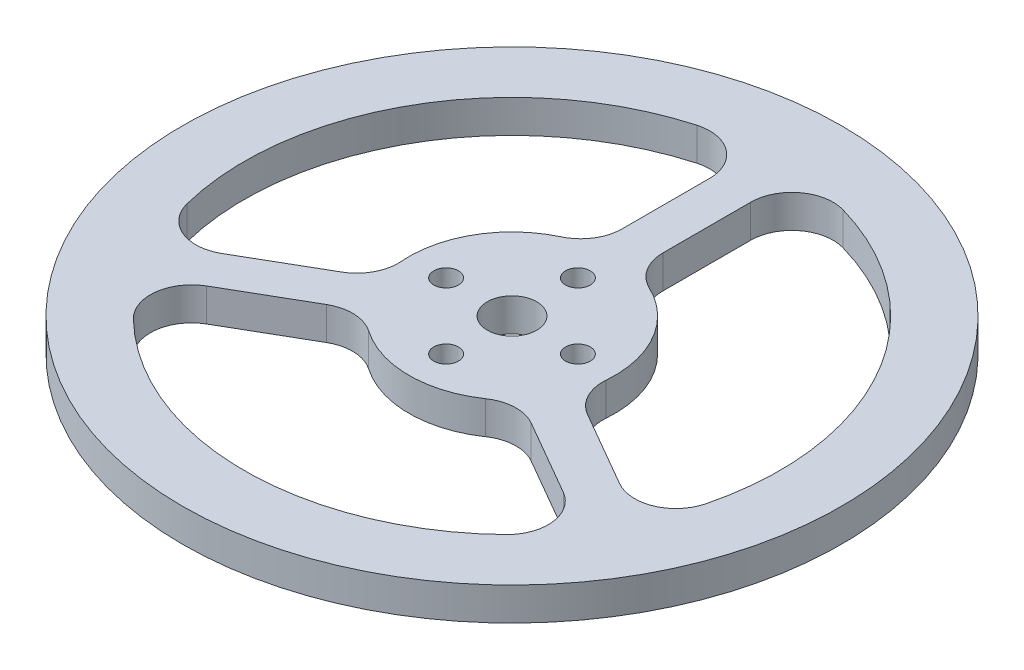
ISO-10303-21;
HEADER;
FILE_DESCRIPTION(('STEP AP214'),'2;1');
FILE_NAME('part.step','',(''),(''),'','','');
FILE_SCHEMA(('AUTOMOTIVE_DESIGN { 1 0 10303 214 1 1 1 1 }'));
ENDSEC;
DATA;
#1=APPLICATION_CONTEXT('core data for automotive mechanical design processes');
#2=APPLICATION_PROTOCOL_DEFINITION('international standard','automotive_design',2000,#1);
#3=PRODUCT_CONTEXT('',#1,'mechanical');
#4=PRODUCT('Part','Part','',(#3));
#5=PRODUCT_RELATED_PRODUCT_CATEGORY('part','',(#4));
#6=PRODUCT_DEFINITION_FORMATION('','',#4);
#7=PRODUCT_DEFINITION_CONTEXT('part definition',#1,'design');
#8=PRODUCT_DEFINITION('design','',#6,#7);
#9=PRODUCT_DEFINITION_SHAPE('','',#8);
#10=(LENGTH_UNIT() NAMED_UNIT(*) SI_UNIT(.MILLI.,.METRE.));
#11=(NAMED_UNIT(*) PLANE_ANGLE_UNIT() SI_UNIT($,.RADIAN.));
#12=(NAMED_UNIT(*) SI_UNIT($,.STERADIAN.) SOLID_ANGLE_UNIT());
#13=UNCERTAINTY_MEASURE_WITH_UNIT(LENGTH_MEASURE(1.E-05),#10,'distance_accuracy_value','');
#14=(GEOMETRIC_REPRESENTATION_CONTEXT(3) GLOBAL_UNCERTAINTY_ASSIGNED_CONTEXT((#13)) GLOBAL_UNIT_ASSIGNED_CONTEXT((#10,
#11,#12)) REPRESENTATION_CONTEXT('',''));
#15=CARTESIAN_POINT('',(0.,0.,0.));
#16=DIRECTION('',(0.,0.,1.));
#17=DIRECTION('',(1.,0.,0.));
#18=AXIS2_PLACEMENT_3D('',#15,#16,#17);
#19=CARTESIAN_POINT('',(0.,4.,0.));
#20=DIRECTION('',(0.,1.,0.));
#21=DIRECTION('',(0.,0.,1.));
#22=AXIS2_PLACEMENT_3D('',#19,#20,#21);
#23=PLANE('',#22);
#24=CARTESIAN_POINT('',(8.,4.,0.));
#25=DIRECTION('',(0.,1.,0.));
#26=DIRECTION('',(0.,0.,1.));
#27=AXIS2_PLACEMENT_3D('',#24,#25,#26);
#28=CIRCLE('',#27,1.5);
#29=CARTESIAN_POINT('',(8.,4.,1.5));
#30=VERTEX_POINT('',#29);
#31=EDGE_CURVE('E437',#30,#30,#28,.T.);
#32=ORIENTED_EDGE('',*,*,#31,.F.);
#33=EDGE_LOOP('',(#32));
#34=FACE_BOUND('',#33,.T.);
#35=CARTESIAN_POINT('',(0.,4.,0.));
#36=DIRECTION('',(0.,1.,0.));
#37=DIRECTION('',(0.,0.,1.));
#38=AXIS2_PLACEMENT_3D('',#35,#36,#37);
#39=CIRCLE('',#38,3.);
#40=CARTESIAN_POINT('',(0.,4.,3.));
#41=VERTEX_POINT('',#40);
#42=EDGE_CURVE('E432',#41,#41,#39,.T.);
#43=ORIENTED_EDGE('',*,*,#42,.F.);
#44=EDGE_LOOP('',(#43));
#45=FACE_BOUND('',#44,.T.);
#46=CARTESIAN_POINT('',(0.,4.,8.));
#47=DIRECTION('',(0.,1.,0.));
#48=DIRECTION('',(0.,0.,1.));
#49=AXIS2_PLACEMENT_3D('',#46,#47,#48);
#50=CIRCLE('',#49,1.5);
#51=CARTESIAN_POINT('',(0.,4.,9.5));
#52=VERTEX_POINT('',#51);
#53=EDGE_CURVE('E445',#52,#52,#50,.T.);
#54=ORIENTED_EDGE('',*,*,#53,.F.);
#55=EDGE_LOOP('',(#54));
#56=FACE_BOUND('',#55,.T.);
#57=CARTESIAN_POINT('',(-8.,4.,0.));
#58=DIRECTION('',(0.,1.,0.));
#59=DIRECTION('',(0.,0.,1.));
#60=AXIS2_PLACEMENT_3D('',#57,#58,#59);
#61=CIRCLE('',#60,1.5);
#62=CARTESIAN_POINT('',(-8.,4.,1.5));
#63=VERTEX_POINT('',#62);
#64=EDGE_CURVE('E444',#63,#63,#61,.T.);
#65=ORIENTED_EDGE('',*,*,#64,.F.);
#66=EDGE_LOOP('',(#65));
#67=FACE_BOUND('',#66,.T.);
#68=CARTESIAN_POINT('',(0.,4.,-8.));
#69=DIRECTION('',(0.,1.,0.));
#70=DIRECTION('',(0.,0.,1.));
#71=AXIS2_PLACEMENT_3D('',#68,#69,#70);
#72=CIRCLE('',#71,1.5);
#73=CARTESIAN_POINT('',(0.,4.,-6.5));
#74=VERTEX_POINT('',#73);
#75=EDGE_CURVE('E455',#74,#74,#72,.T.);
#76=ORIENTED_EDGE('',*,*,#75,.F.);
#77=EDGE_LOOP('',(#76));
#78=FACE_BOUND('',#77,.T.);
#79=CARTESIAN_POINT('',(0.,4.,0.));
#80=DIRECTION('',(0.,1.,0.));
#81=DIRECTION('',(0.,0.,1.));
#82=AXIS2_PLACEMENT_3D('',#79,#80,#81);
#83=CIRCLE('',#82,40.);
#84=CARTESIAN_POINT('',(0.,4.,40.));
#85=VERTEX_POINT('',#84);
#86=EDGE_CURVE('E463',#85,#85,#83,.T.);
#87=ORIENTED_EDGE('',*,*,#86,.T.);
#88=EDGE_LOOP('',(#87));
#89=FACE_BOUND('',#88,.T.);
#90=DIRECTION('',(0.,0.,-1.));
#91=VECTOR('',#90,1.);
#92=CARTESIAN_POINT('',(-2.4721976034128,4.,0.));
#93=LINE('',#92,#91);
#94=CARTESIAN_POINT('',(-2.4721976034128,4.,-15.82454621705));
#95=VERTEX_POINT('',#94);
#96=CARTESIAN_POINT('',(-2.4721976034128,4.,-26.4653785723075));
#97=VERTEX_POINT('',#96);
#98=EDGE_CURVE('E423',#95,#97,#93,.T.);
#99=ORIENTED_EDGE('',*,*,#98,.F.);
#100=CARTESIAN_POINT('',(-7.4721976034128,4.,-15.82454621705));
#101=DIRECTION('',(0.,1.,0.));
#102=DIRECTION('',(0.,0.,1.));
#103=AXIS2_PLACEMENT_3D('',#100,#101,#102);
#104=CIRCLE('',#103,5.);
#105=CARTESIAN_POINT('',(-5.33728400243771,4.,-11.3032472978929));
#106=VERTEX_POINT('',#105);
#107=EDGE_CURVE('E290',#95,#106,#104,.F.);
#108=ORIENTED_EDGE('',*,*,#107,.T.);
#109=CARTESIAN_POINT('',(0.,4.,0.));
#110=DIRECTION('',(0.,1.,0.));
#111=DIRECTION('',(0.,0.,1.));
#112=AXIS2_PLACEMENT_3D('',#109,#110,#111);
#113=CIRCLE('',#112,12.5);
#114=CARTESIAN_POINT('',(-12.4610844162261,4.,0.985583670566415));
#115=VERTEX_POINT('',#114);
#116=EDGE_CURVE('E420',#106,#115,#113,.T.);
#117=ORIENTED_EDGE('',*,*,#116,.T.);
#118=CARTESIAN_POINT('',(-17.4455181827165,4.,1.37981713879298));
#119=DIRECTION('',(0.,1.,0.));
#120=DIRECTION('',(0.,0.,1.));
#121=AXIS2_PLACEMENT_3D('',#118,#119,#120);
#122=CIRCLE('',#121,5.);
#123=CARTESIAN_POINT('',(-14.9455181827165,4.,5.70994415771517));
#124=VERTEX_POINT('',#123);
#125=EDGE_CURVE('E294',#115,#124,#122,.F.);
#126=ORIENTED_EDGE('',*,*,#125,.T.);
#127=DIRECTION('',(-0.866025403784438,0.,0.5));
#128=VECTOR('',#127,1.);
#129=CARTESIAN_POINT('',(-1.2639011982932,4.,-2.189141091191));
#130=LINE('',#129,#128);
#131=CARTESIAN_POINT('',(-24.1699406488063,4.,11.0356669516309));
#132=VERTEX_POINT('',#131);
#133=EDGE_CURVE('E429',#124,#132,#130,.T.);
#134=ORIENTED_EDGE('',*,*,#133,.T.);
#135=CARTESIAN_POINT('',(-26.6699406488063,4.,6.70553993270872));
#136=DIRECTION('',(0.,1.,0.));
#137=DIRECTION('',(0.,0.,1.));
#138=AXIS2_PLACEMENT_3D('',#135,#136,#137);
#139=CIRCLE('',#138,5.);
#140=CARTESIAN_POINT('',(-31.519020766771,4.,7.92472901138304));
#141=VERTEX_POINT('',#140);
#142=EDGE_CURVE('E277',#132,#141,#139,.F.);
#143=ORIENTED_EDGE('',*,*,#142,.T.);
#144=CARTESIAN_POINT('',(0.,4.,0.));
#145=DIRECTION('',(0.,1.,0.));
#146=DIRECTION('',(0.,0.,1.));
#147=AXIS2_PLACEMENT_3D('',#144,#145,#146);
#148=CIRCLE('',#147,32.5);
#149=CARTESIAN_POINT('',(-8.83077898585149,4.,-31.2772655854543));
#150=VERTEX_POINT('',#149);
#151=EDGE_CURVE('E426',#150,#141,#148,.T.);
#152=ORIENTED_EDGE('',*,*,#151,.F.);
#153=CARTESIAN_POINT('',(-7.4721976034128,4.,-26.4653785723075));
#154=DIRECTION('',(0.,1.,0.));
#155=DIRECTION('',(0.,0.,1.));
#156=AXIS2_PLACEMENT_3D('',#153,#154,#155);
#157=CIRCLE('',#156,5.);
#158=EDGE_CURVE('E286',#150,#97,#157,.F.);
#159=ORIENTED_EDGE('',*,*,#158,.T.);
#160=EDGE_LOOP('',(#99,#108,#117,#126,#134,#143,#152,#159));
#161=FACE_BOUND('',#160,.T.);
#162=DIRECTION('',(-0.866025403784438,0.,0.5));
#163=VECTOR('',#162,1.);
#164=CARTESIAN_POINT('',(1.23609880170681,4.,2.14098592773119));
#165=LINE('',#164,#163);
#166=CARTESIAN_POINT('',(-12.4683602256191,4.,10.053259036256));
#167=VERTEX_POINT('',#166);
#168=CARTESIAN_POINT('',(-21.6835913626836,4.,15.3736752138848));
#169=VERTEX_POINT('',#168);
#170=EDGE_CURVE('E411',#167,#169,#165,.T.);
#171=ORIENTED_EDGE('',*,*,#170,.F.);
#172=CARTESIAN_POINT('',(-9.96836022561911,4.,14.3833860551782));
#173=DIRECTION('',(0.,1.,0.));
#174=DIRECTION('',(0.,0.,1.));
#175=AXIS2_PLACEMENT_3D('',#172,#173,#174);
#176=CIRCLE('',#175,5.);
#177=CARTESIAN_POINT('',(-7.12025730401365,4.,10.2738471822701));
#178=VERTEX_POINT('',#177);
#179=EDGE_CURVE('E278',#167,#178,#176,.F.);
#180=ORIENTED_EDGE('',*,*,#179,.T.);
#181=CARTESIAN_POINT('',(0.,4.,0.));
#182=DIRECTION('',(0.,1.,0.));
#183=DIRECTION('',(0.,0.,1.));
#184=AXIS2_PLACEMENT_3D('',#181,#182,#183);
#185=CIRCLE('',#184,12.5);
#186=CARTESIAN_POINT('',(7.08408270437887,4.,10.2988238278708));
#187=VERTEX_POINT('',#186);
#188=EDGE_CURVE('E255',#178,#187,#185,.T.);
#189=ORIENTED_EDGE('',*,*,#188,.T.);
#190=CARTESIAN_POINT('',(9.91771578613042,4.,14.4183533590192));
#191=DIRECTION('',(0.,1.,0.));
#192=DIRECTION('',(0.,0.,1.));
#193=AXIS2_PLACEMENT_3D('',#190,#191,#192);
#194=CIRCLE('',#193,5.);
#195=CARTESIAN_POINT('',(12.4177157861304,4.,10.088226340097));
#196=VERTEX_POINT('',#195);
#197=EDGE_CURVE('E353',#187,#196,#194,.F.);
#198=ORIENTED_EDGE('',*,*,#197,.T.);
#199=DIRECTION('',(0.866025403784439,0.,0.5));
#200=VECTOR('',#199,1.);
#201=CARTESIAN_POINT('',(-1.26390119829305,4.,2.18914109119074));
#202=LINE('',#201,#200);
#203=CARTESIAN_POINT('',(21.6421382522201,4.,15.4139491340127));
#204=VERTEX_POINT('',#203);
#205=EDGE_CURVE('E358',#196,#204,#202,.T.);
#206=ORIENTED_EDGE('',*,*,#205,.T.);
#207=CARTESIAN_POINT('',(19.1421382522201,4.,19.7440761529349));
#208=DIRECTION('',(0.,1.,0.));
#209=DIRECTION('',(0.,0.,1.));
#210=AXIS2_PLACEMENT_3D('',#207,#208,#209);
#211=CIRCLE('',#210,5.);
#212=CARTESIAN_POINT('',(22.622527025351,4.,23.3339081807412));
#213=VERTEX_POINT('',#212);
#214=EDGE_CURVE('E298',#204,#213,#211,.F.);
#215=ORIENTED_EDGE('',*,*,#214,.T.);
#216=CARTESIAN_POINT('',(0.,4.,0.));
#217=DIRECTION('',(0.,1.,0.));
#218=DIRECTION('',(0.,0.,1.));
#219=AXIS2_PLACEMENT_3D('',#216,#217,#218);
#220=CIRCLE('',#219,32.5);
#221=CARTESIAN_POINT('',(-22.6715170649897,4.,23.286311729681));
#222=VERTEX_POINT('',#221);
#223=EDGE_CURVE('E369',#222,#213,#220,.T.);
#224=ORIENTED_EDGE('',*,*,#223,.F.);
#225=CARTESIAN_POINT('',(-19.1835913626836,4.,19.703802232807));
#226=DIRECTION('',(0.,1.,0.));
#227=DIRECTION('',(0.,0.,1.));
#228=AXIS2_PLACEMENT_3D('',#225,#226,#227);
#229=CIRCLE('',#228,5.);
#230=EDGE_CURVE('E306',#222,#169,#229,.F.);
#231=ORIENTED_EDGE('',*,*,#230,.T.);
#232=EDGE_LOOP('',(#171,#180,#189,#198,#206,#215,#224,#231));
#233=FACE_BOUND('',#232,.T.);
#234=DIRECTION('',(0.866025403784439,0.,0.5));
#235=VECTOR('',#234,1.);
#236=CARTESIAN_POINT('',(1.23609880170695,4.,-2.14098592773145));
#237=LINE('',#236,#235);
#238=CARTESIAN_POINT('',(14.9405578290328,4.,5.77128718079329));
#239=VERTEX_POINT('',#238);
#240=CARTESIAN_POINT('',(24.1557889660973,4.,11.0917033584221));
#241=VERTEX_POINT('',#240);
#242=EDGE_CURVE('E329',#239,#241,#237,.T.);
#243=ORIENTED_EDGE('',*,*,#242,.F.);
#244=CARTESIAN_POINT('',(17.4405578290328,4.,1.4411601618711));
#245=DIRECTION('',(0.,1.,0.));
#246=DIRECTION('',(0.,0.,1.));
#247=AXIS2_PLACEMENT_3D('',#244,#245,#246);
#248=CIRCLE('',#247,5.);
#249=CARTESIAN_POINT('',(12.457541306452,4.,1.02940011562221));
#250=VERTEX_POINT('',#249);
#251=EDGE_CURVE('E310',#239,#250,#248,.F.);
#252=ORIENTED_EDGE('',*,*,#251,.T.);
#253=CARTESIAN_POINT('',(0.,4.,0.));
#254=DIRECTION('',(0.,1.,0.));
#255=DIRECTION('',(0.,0.,1.));
#256=AXIS2_PLACEMENT_3D('',#253,#254,#255);
#257=CIRCLE('',#256,12.5);
#258=CARTESIAN_POINT('',(5.377001711848,4.,-11.2844074984371));
#259=VERTEX_POINT('',#258);
#260=EDGE_CURVE('E368',#250,#259,#257,.T.);
#261=ORIENTED_EDGE('',*,*,#260,.T.);
#262=CARTESIAN_POINT('',(7.5278023965872,4.,-15.798170497812));
#263=DIRECTION('',(0.,1.,0.));
#264=DIRECTION('',(0.,0.,1.));
#265=AXIS2_PLACEMENT_3D('',#262,#263,#264);
#266=CIRCLE('',#265,5.);
#267=CARTESIAN_POINT('',(2.5278023965872,4.,-15.798170497812));
#268=VERTEX_POINT('',#267);
#269=EDGE_CURVE('E108',#259,#268,#266,.F.);
#270=ORIENTED_EDGE('',*,*,#269,.T.);
#271=DIRECTION('',(0.,0.,-1.));
#272=VECTOR('',#271,1.);
#273=CARTESIAN_POINT('',(2.5278023965872,4.,0.));
#274=LINE('',#273,#272);
#275=CARTESIAN_POINT('',(2.5278023965872,4.,-26.4496160856436));
#276=VERTEX_POINT('',#275);
#277=EDGE_CURVE('E320',#268,#276,#274,.T.);
#278=ORIENTED_EDGE('',*,*,#277,.T.);
#279=CARTESIAN_POINT('',(7.5278023965872,4.,-26.4496160856436));
#280=DIRECTION('',(0.,1.,0.));
#281=DIRECTION('',(0.,0.,1.));
#282=AXIS2_PLACEMENT_3D('',#279,#280,#281);
#283=CIRCLE('',#282,5.);
#284=CARTESIAN_POINT('',(8.89649374142124,4.,-31.2586371921242));
#285=VERTEX_POINT('',#284);
#286=EDGE_CURVE('E94',#276,#285,#283,.F.);
#287=ORIENTED_EDGE('',*,*,#286,.T.);
#288=CARTESIAN_POINT('',(0.,4.,0.));
#289=DIRECTION('',(0.,1.,0.));
#290=DIRECTION('',(0.,0.,1.));
#291=AXIS2_PLACEMENT_3D('',#288,#289,#290);
#292=CIRCLE('',#291,32.5);
#293=CARTESIAN_POINT('',(31.5022960508423,4.,7.99095385577265));
#294=VERTEX_POINT('',#293);
#295=EDGE_CURVE('E319',#294,#285,#292,.T.);
#296=ORIENTED_EDGE('',*,*,#295,.F.);
#297=CARTESIAN_POINT('',(26.6557889660973,4.,6.76157633949993));
#298=DIRECTION('',(0.,1.,0.));
#299=DIRECTION('',(0.,0.,1.));
#300=AXIS2_PLACEMENT_3D('',#297,#298,#299);
#301=CIRCLE('',#300,5.);
#302=EDGE_CURVE('E302',#294,#241,#301,.F.);
#303=ORIENTED_EDGE('',*,*,#302,.T.);
#304=EDGE_LOOP('',(#243,#252,#261,#270,#278,#287,#296,#303));
#305=FACE_BOUND('',#304,.T.);
#306=ADVANCED_FACE('F86',(#34,#45,#56,#67,#78,#89,#161,#233,#305),#23,.T.);
#307=CARTESIAN_POINT('',(0.,0.,0.));
#308=DIRECTION('',(0.,1.,0.));
#309=DIRECTION('',(0.,0.,1.));
#310=AXIS2_PLACEMENT_3D('',#307,#308,#309);
#311=PLANE('',#310);
#312=CARTESIAN_POINT('',(0.,0.,0.));
#313=DIRECTION('',(0.,1.,0.));
#314=DIRECTION('',(0.,0.,1.));
#315=AXIS2_PLACEMENT_3D('',#312,#313,#314);
#316=CIRCLE('',#315,12.5);
#317=CARTESIAN_POINT('',(-7.12025730401365,0.,10.2738471822701));
#318=VERTEX_POINT('',#317);
#319=CARTESIAN_POINT('',(7.08408270437887,0.,10.2988238278708));
#320=VERTEX_POINT('',#319);
#321=EDGE_CURVE('E252',#318,#320,#316,.T.);
#322=ORIENTED_EDGE('',*,*,#321,.F.);
#323=CARTESIAN_POINT('',(-9.96836022561911,0.,14.3833860551782));
#324=DIRECTION('',(0.,1.,0.));
#325=DIRECTION('',(0.,0.,1.));
#326=AXIS2_PLACEMENT_3D('',#323,#324,#325);
#327=CIRCLE('',#326,5.);
#328=CARTESIAN_POINT('',(-12.4683602256191,0.,10.053259036256));
#329=VERTEX_POINT('',#328);
#330=EDGE_CURVE('E265',#318,#329,#327,.T.);
#331=ORIENTED_EDGE('',*,*,#330,.T.);
#332=DIRECTION('',(-0.866025403784438,0.,0.5));
#333=VECTOR('',#332,1.);
#334=CARTESIAN_POINT('',(1.23609880170681,0.,2.14098592773119));
#335=LINE('',#334,#333);
#336=CARTESIAN_POINT('',(-21.6835913626836,0.,15.3736752138848));
#337=VERTEX_POINT('',#336);
#338=EDGE_CURVE('E480',#329,#337,#335,.T.);
#339=ORIENTED_EDGE('',*,*,#338,.T.);
#340=CARTESIAN_POINT('',(-19.1835913626836,0.,19.703802232807));
#341=DIRECTION('',(0.,1.,0.));
#342=DIRECTION('',(0.,0.,1.));
#343=AXIS2_PLACEMENT_3D('',#340,#341,#342);
#344=CIRCLE('',#343,5.);
#345=CARTESIAN_POINT('',(-22.6715170649897,0.,23.286311729681));
#346=VERTEX_POINT('',#345);
#347=EDGE_CURVE('E308',#337,#346,#344,.T.);
#348=ORIENTED_EDGE('',*,*,#347,.T.);
#349=CARTESIAN_POINT('',(0.,0.,0.));
#350=DIRECTION('',(0.,1.,0.));
#351=DIRECTION('',(0.,0.,1.));
#352=AXIS2_PLACEMENT_3D('',#349,#350,#351);
#353=CIRCLE('',#352,32.5);
#354=CARTESIAN_POINT('',(22.622527025351,0.,23.3339081807412));
#355=VERTEX_POINT('',#354);
#356=EDGE_CURVE('E407',#346,#355,#353,.T.);
#357=ORIENTED_EDGE('',*,*,#356,.T.);
#358=CARTESIAN_POINT('',(19.1421382522201,0.,19.7440761529349));
#359=DIRECTION('',(0.,1.,0.));
#360=DIRECTION('',(0.,0.,1.));
#361=AXIS2_PLACEMENT_3D('',#358,#359,#360);
#362=CIRCLE('',#361,5.);
#363=CARTESIAN_POINT('',(21.6421382522201,0.,15.4139491340127));
#364=VERTEX_POINT('',#363);
#365=EDGE_CURVE('E300',#355,#364,#362,.T.);
#366=ORIENTED_EDGE('',*,*,#365,.T.);
#367=DIRECTION('',(0.866025403784439,0.,0.5));
#368=VECTOR('',#367,1.);
#369=CARTESIAN_POINT('',(-1.26390119829305,0.,2.18914109119074));
#370=LINE('',#369,#368);
#371=CARTESIAN_POINT('',(12.4177157861304,0.,10.088226340097));
#372=VERTEX_POINT('',#371);
#373=EDGE_CURVE('E271',#372,#364,#370,.T.);
#374=ORIENTED_EDGE('',*,*,#373,.F.);
#375=CARTESIAN_POINT('',(9.91771578613042,0.,14.4183533590192));
#376=DIRECTION('',(0.,1.,0.));
#377=DIRECTION('',(0.,0.,1.));
#378=AXIS2_PLACEMENT_3D('',#375,#376,#377);
#379=CIRCLE('',#378,5.);
#380=EDGE_CURVE('E269',#372,#320,#379,.T.);
#381=ORIENTED_EDGE('',*,*,#380,.T.);
#382=EDGE_LOOP('',(#322,#331,#339,#348,#357,#366,#374,#381));
#383=FACE_BOUND('',#382,.T.);
#384=CARTESIAN_POINT('',(0.,0.,0.));
#385=DIRECTION('',(0.,1.,0.));
#386=DIRECTION('',(0.,0.,1.));
#387=AXIS2_PLACEMENT_3D('',#384,#385,#386);
#388=CIRCLE('',#387,40.);
#389=CARTESIAN_POINT('',(0.,0.,40.));
#390=VERTEX_POINT('',#389);
#391=EDGE_CURVE('E436',#390,#390,#388,.T.);
#392=ORIENTED_EDGE('',*,*,#391,.F.);
#393=EDGE_LOOP('',(#392));
#394=FACE_BOUND('',#393,.T.);
#395=CARTESIAN_POINT('',(0.,0.,-8.));
#396=DIRECTION('',(0.,1.,0.));
#397=DIRECTION('',(0.,0.,1.));
#398=AXIS2_PLACEMENT_3D('',#395,#396,#397);
#399=CIRCLE('',#398,1.5);
#400=CARTESIAN_POINT('',(0.,0.,-6.5));
#401=VERTEX_POINT('',#400);
#402=EDGE_CURVE('E440',#401,#401,#399,.T.);
#403=ORIENTED_EDGE('',*,*,#402,.T.);
#404=EDGE_LOOP('',(#403));
#405=FACE_BOUND('',#404,.T.);
#406=CARTESIAN_POINT('',(-8.,0.,0.));
#407=DIRECTION('',(0.,1.,0.));
#408=DIRECTION('',(0.,0.,1.));
#409=AXIS2_PLACEMENT_3D('',#406,#407,#408);
#410=CIRCLE('',#409,1.5);
#411=CARTESIAN_POINT('',(-8.,0.,1.5));
#412=VERTEX_POINT('',#411);
#413=EDGE_CURVE('E458',#412,#412,#410,.T.);
#414=ORIENTED_EDGE('',*,*,#413,.T.);
#415=EDGE_LOOP('',(#414));
#416=FACE_BOUND('',#415,.T.);
#417=CARTESIAN_POINT('',(0.,0.,8.));
#418=DIRECTION('',(0.,1.,0.));
#419=DIRECTION('',(0.,0.,1.));
#420=AXIS2_PLACEMENT_3D('',#417,#418,#419);
#421=CIRCLE('',#420,1.5);
#422=CARTESIAN_POINT('',(0.,0.,9.5));
#423=VERTEX_POINT('',#422);
#424=EDGE_CURVE('E441',#423,#423,#421,.T.);
#425=ORIENTED_EDGE('',*,*,#424,.T.);
#426=EDGE_LOOP('',(#425));
#427=FACE_BOUND('',#426,.T.);
#428=CARTESIAN_POINT('',(0.,0.,0.));
#429=DIRECTION('',(0.,1.,0.));
#430=DIRECTION('',(0.,0.,1.));
#431=AXIS2_PLACEMENT_3D('',#428,#429,#430);
#432=CIRCLE('',#431,3.);
#433=CARTESIAN_POINT('',(0.,0.,3.));
#434=VERTEX_POINT('',#433);
#435=EDGE_CURVE('E448',#434,#434,#432,.T.);
#436=ORIENTED_EDGE('',*,*,#435,.T.);
#437=EDGE_LOOP('',(#436));
#438=FACE_BOUND('',#437,.T.);
#439=CARTESIAN_POINT('',(8.,0.,0.));
#440=DIRECTION('',(0.,1.,0.));
#441=DIRECTION('',(0.,0.,1.));
#442=AXIS2_PLACEMENT_3D('',#439,#440,#441);
#443=CIRCLE('',#442,1.5);
#444=CARTESIAN_POINT('',(8.,0.,1.5));
#445=VERTEX_POINT('',#444);
#446=EDGE_CURVE('E433',#445,#445,#443,.T.);
#447=ORIENTED_EDGE('',*,*,#446,.T.);
#448=EDGE_LOOP('',(#447));
#449=FACE_BOUND('',#448,.T.);
#450=CARTESIAN_POINT('',(0.,0.,0.));
#451=DIRECTION('',(0.,1.,0.));
#452=DIRECTION('',(0.,0.,1.));
#453=AXIS2_PLACEMENT_3D('',#450,#451,#452);
#454=CIRCLE('',#453,12.5);
#455=CARTESIAN_POINT('',(-5.33728400243771,0.,-11.3032472978929));
#456=VERTEX_POINT('',#455);
#457=CARTESIAN_POINT('',(-12.4610844162261,0.,0.985583670566415));
#458=VERTEX_POINT('',#457);
#459=EDGE_CURVE('E477',#456,#458,#454,.T.);
#460=ORIENTED_EDGE('',*,*,#459,.F.);
#461=CARTESIAN_POINT('',(-7.4721976034128,0.,-15.82454621705));
#462=DIRECTION('',(0.,1.,0.));
#463=DIRECTION('',(0.,0.,1.));
#464=AXIS2_PLACEMENT_3D('',#461,#462,#463);
#465=CIRCLE('',#464,5.);
#466=CARTESIAN_POINT('',(-2.4721976034128,0.,-15.82454621705));
#467=VERTEX_POINT('',#466);
#468=EDGE_CURVE('E292',#456,#467,#465,.T.);
#469=ORIENTED_EDGE('',*,*,#468,.T.);
#470=DIRECTION('',(0.,0.,-1.));
#471=VECTOR('',#470,1.);
#472=CARTESIAN_POINT('',(-2.4721976034128,0.,0.));
#473=LINE('',#472,#471);
#474=CARTESIAN_POINT('',(-2.4721976034128,0.,-26.4653785723075));
#475=VERTEX_POINT('',#474);
#476=EDGE_CURVE('E466',#467,#475,#473,.T.);
#477=ORIENTED_EDGE('',*,*,#476,.T.);
#478=CARTESIAN_POINT('',(-7.4721976034128,0.,-26.4653785723075));
#479=DIRECTION('',(0.,1.,0.));
#480=DIRECTION('',(0.,0.,1.));
#481=AXIS2_PLACEMENT_3D('',#478,#479,#480);
#482=CIRCLE('',#481,5.);
#483=CARTESIAN_POINT('',(-8.83077898585149,0.,-31.2772655854543));
#484=VERTEX_POINT('',#483);
#485=EDGE_CURVE('E288',#475,#484,#482,.T.);
#486=ORIENTED_EDGE('',*,*,#485,.T.);
#487=CARTESIAN_POINT('',(0.,0.,0.));
#488=DIRECTION('',(0.,1.,0.));
#489=DIRECTION('',(0.,0.,1.));
#490=AXIS2_PLACEMENT_3D('',#487,#488,#489);
#491=CIRCLE('',#490,32.5);
#492=CARTESIAN_POINT('',(-31.519020766771,0.,7.92472901138304));
#493=VERTEX_POINT('',#492);
#494=EDGE_CURVE('E471',#484,#493,#491,.T.);
#495=ORIENTED_EDGE('',*,*,#494,.T.);
#496=CARTESIAN_POINT('',(-26.6699406488063,0.,6.70553993270872));
#497=DIRECTION('',(0.,1.,0.));
#498=DIRECTION('',(0.,0.,1.));
#499=AXIS2_PLACEMENT_3D('',#496,#497,#498);
#500=CIRCLE('',#499,5.);
#501=CARTESIAN_POINT('',(-24.1699406488063,0.,11.0356669516309));
#502=VERTEX_POINT('',#501);
#503=EDGE_CURVE('E280',#493,#502,#500,.T.);
#504=ORIENTED_EDGE('',*,*,#503,.T.);
#505=DIRECTION('',(-0.866025403784438,0.,0.5));
#506=VECTOR('',#505,1.);
#507=CARTESIAN_POINT('',(-1.2639011982932,0.,-2.189141091191));
#508=LINE('',#507,#506);
#509=CARTESIAN_POINT('',(-14.9455181827165,0.,5.70994415771517));
#510=VERTEX_POINT('',#509);
#511=EDGE_CURVE('E474',#510,#502,#508,.T.);
#512=ORIENTED_EDGE('',*,*,#511,.F.);
#513=CARTESIAN_POINT('',(-17.4455181827165,0.,1.37981713879298));
#514=DIRECTION('',(0.,1.,0.));
#515=DIRECTION('',(0.,0.,1.));
#516=AXIS2_PLACEMENT_3D('',#513,#514,#515);
#517=CIRCLE('',#516,5.);
#518=EDGE_CURVE('E296',#510,#458,#517,.T.);
#519=ORIENTED_EDGE('',*,*,#518,.T.);
#520=EDGE_LOOP('',(#460,#469,#477,#486,#495,#504,#512,#519));
#521=FACE_BOUND('',#520,.T.);
#522=CARTESIAN_POINT('',(0.,0.,0.));
#523=DIRECTION('',(0.,1.,0.));
#524=DIRECTION('',(0.,0.,1.));
#525=AXIS2_PLACEMENT_3D('',#522,#523,#524);
#526=CIRCLE('',#525,12.5);
#527=CARTESIAN_POINT('',(12.457541306452,0.,1.02940011562221));
#528=VERTEX_POINT('',#527);
#529=CARTESIAN_POINT('',(5.377001711848,0.,-11.2844074984371));
#530=VERTEX_POINT('',#529);
#531=EDGE_CURVE('E259',#528,#530,#526,.T.);
#532=ORIENTED_EDGE('',*,*,#531,.F.);
#533=CARTESIAN_POINT('',(17.4405578290328,0.,1.4411601618711));
#534=DIRECTION('',(0.,1.,0.));
#535=DIRECTION('',(0.,0.,1.));
#536=AXIS2_PLACEMENT_3D('',#533,#534,#535);
#537=CIRCLE('',#536,5.);
#538=CARTESIAN_POINT('',(14.9405578290328,0.,5.77128718079329));
#539=VERTEX_POINT('',#538);
#540=EDGE_CURVE('E312',#528,#539,#537,.T.);
#541=ORIENTED_EDGE('',*,*,#540,.T.);
#542=DIRECTION('',(0.866025403784439,0.,0.5));
#543=VECTOR('',#542,1.);
#544=CARTESIAN_POINT('',(1.23609880170695,0.,-2.14098592773145));
#545=LINE('',#544,#543);
#546=CARTESIAN_POINT('',(24.1557889660973,0.,11.0917033584221));
#547=VERTEX_POINT('',#546);
#548=EDGE_CURVE('E270',#539,#547,#545,.T.);
#549=ORIENTED_EDGE('',*,*,#548,.T.);
#550=CARTESIAN_POINT('',(26.6557889660973,0.,6.76157633949993));
#551=DIRECTION('',(0.,1.,0.));
#552=DIRECTION('',(0.,0.,1.));
#553=AXIS2_PLACEMENT_3D('',#550,#551,#552);
#554=CIRCLE('',#553,5.);
#555=CARTESIAN_POINT('',(31.5022960508423,0.,7.99095385577265));
#556=VERTEX_POINT('',#555);
#557=EDGE_CURVE('E304',#547,#556,#554,.T.);
#558=ORIENTED_EDGE('',*,*,#557,.T.);
#559=CARTESIAN_POINT('',(0.,0.,0.));
#560=DIRECTION('',(0.,1.,0.));
#561=DIRECTION('',(0.,0.,1.));
#562=AXIS2_PLACEMENT_3D('',#559,#560,#561);
#563=CIRCLE('',#562,32.5);
#564=CARTESIAN_POINT('',(8.89649374142124,0.,-31.2586371921242));
#565=VERTEX_POINT('',#564);
#566=EDGE_CURVE('E486',#556,#565,#563,.T.);
#567=ORIENTED_EDGE('',*,*,#566,.T.);
#568=CARTESIAN_POINT('',(7.5278023965872,0.,-26.4496160856436));
#569=DIRECTION('',(0.,1.,0.));
#570=DIRECTION('',(0.,0.,1.));
#571=AXIS2_PLACEMENT_3D('',#568,#569,#570);
#572=CIRCLE('',#571,5.);
#573=CARTESIAN_POINT('',(2.5278023965872,0.,-26.4496160856436));
#574=VERTEX_POINT('',#573);
#575=EDGE_CURVE('E12',#565,#574,#572,.T.);
#576=ORIENTED_EDGE('',*,*,#575,.T.);
#577=DIRECTION('',(0.,0.,-1.));
#578=VECTOR('',#577,1.);
#579=CARTESIAN_POINT('',(2.5278023965872,0.,0.));
#580=LINE('',#579,#578);
#581=CARTESIAN_POINT('',(2.5278023965872,0.,-15.798170497812));
#582=VERTEX_POINT('',#581);
#583=EDGE_CURVE('E488',#582,#574,#580,.T.);
#584=ORIENTED_EDGE('',*,*,#583,.F.);
#585=CARTESIAN_POINT('',(7.5278023965872,0.,-15.798170497812));
#586=DIRECTION('',(0.,1.,0.));
#587=DIRECTION('',(0.,0.,1.));
#588=AXIS2_PLACEMENT_3D('',#585,#586,#587);
#589=CIRCLE('',#588,5.);
#590=EDGE_CURVE('E315',#582,#530,#589,.T.);
#591=ORIENTED_EDGE('',*,*,#590,.T.);
#592=EDGE_LOOP('',(#532,#541,#549,#558,#567,#576,#584,#591));
#593=FACE_BOUND('',#592,.T.);
#594=ADVANCED_FACE('F262',(#383,#394,#405,#416,#427,#438,#449,#521,#593),#311,.F.);
#595=CARTESIAN_POINT('',(0.,4.,0.));
#596=DIRECTION('',(0.,-1.,0.));
#597=DIRECTION('',(0.,0.,-1.));
#598=AXIS2_PLACEMENT_3D('',#595,#596,#597);
#599=CYLINDRICAL_SURFACE('',#598,40.);
#600=ORIENTED_EDGE('',*,*,#86,.F.);
#601=EDGE_LOOP('',(#600));
#602=FACE_BOUND('',#601,.T.);
#603=ORIENTED_EDGE('',*,*,#391,.T.);
#604=EDGE_LOOP('',(#603));
#605=FACE_BOUND('',#604,.T.);
#606=ADVANCED_FACE('F531',(#602,#605),#599,.T.);
#607=CARTESIAN_POINT('',(0.,0.,-8.));
#608=DIRECTION('',(0.,1.,0.));
#609=DIRECTION('',(0.,0.,1.));
#610=AXIS2_PLACEMENT_3D('',#607,#608,#609);
#611=CYLINDRICAL_SURFACE('',#610,1.5);
#612=ORIENTED_EDGE('',*,*,#402,.F.);
#613=EDGE_LOOP('',(#612));
#614=FACE_BOUND('',#613,.T.);
#615=ORIENTED_EDGE('',*,*,#75,.T.);
#616=EDGE_LOOP('',(#615));
#617=FACE_BOUND('',#616,.T.);
#618=ADVANCED_FACE('F541',(#614,#617),#611,.F.);
#619=CARTESIAN_POINT('',(-8.,0.,0.));
#620=DIRECTION('',(0.,1.,0.));
#621=DIRECTION('',(0.,0.,1.));
#622=AXIS2_PLACEMENT_3D('',#619,#620,#621);
#623=CYLINDRICAL_SURFACE('',#622,1.5);
#624=ORIENTED_EDGE('',*,*,#413,.F.);
#625=EDGE_LOOP('',(#624));
#626=FACE_BOUND('',#625,.T.);
#627=ORIENTED_EDGE('',*,*,#64,.T.);
#628=EDGE_LOOP('',(#627));
#629=FACE_BOUND('',#628,.T.);
#630=ADVANCED_FACE('F536',(#626,#629),#623,.F.);
#631=CARTESIAN_POINT('',(0.,0.,8.));
#632=DIRECTION('',(0.,1.,0.));
#633=DIRECTION('',(0.,0.,1.));
#634=AXIS2_PLACEMENT_3D('',#631,#632,#633);
#635=CYLINDRICAL_SURFACE('',#634,1.5);
#636=ORIENTED_EDGE('',*,*,#424,.F.);
#637=EDGE_LOOP('',(#636));
#638=FACE_BOUND('',#637,.T.);
#639=ORIENTED_EDGE('',*,*,#53,.T.);
#640=EDGE_LOOP('',(#639));
#641=FACE_BOUND('',#640,.T.);
#642=ADVANCED_FACE('F752',(#638,#641),#635,.F.);
#643=CARTESIAN_POINT('',(0.,0.,0.));
#644=DIRECTION('',(0.,1.,0.));
#645=DIRECTION('',(0.,0.,1.));
#646=AXIS2_PLACEMENT_3D('',#643,#644,#645);
#647=CYLINDRICAL_SURFACE('',#646,3.);
#648=ORIENTED_EDGE('',*,*,#435,.F.);
#649=EDGE_LOOP('',(#648));
#650=FACE_BOUND('',#649,.T.);
#651=ORIENTED_EDGE('',*,*,#42,.T.);
#652=EDGE_LOOP('',(#651));
#653=FACE_BOUND('',#652,.T.);
#654=ADVANCED_FACE('F743',(#650,#653),#647,.F.);
#655=CARTESIAN_POINT('',(8.,0.,0.));
#656=DIRECTION('',(0.,1.,0.));
#657=DIRECTION('',(0.,0.,1.));
#658=AXIS2_PLACEMENT_3D('',#655,#656,#657);
#659=CYLINDRICAL_SURFACE('',#658,1.5);
#660=ORIENTED_EDGE('',*,*,#446,.F.);
#661=EDGE_LOOP('',(#660));
#662=FACE_BOUND('',#661,.T.);
#663=ORIENTED_EDGE('',*,*,#31,.T.);
#664=EDGE_LOOP('',(#663));
#665=FACE_BOUND('',#664,.T.);
#666=ADVANCED_FACE('F725',(#662,#665),#659,.F.);
#667=CARTESIAN_POINT('',(0.,-6.,0.));
#668=DIRECTION('',(0.,1.,0.));
#669=DIRECTION('',(0.,0.,1.));
#670=AXIS2_PLACEMENT_3D('',#667,#668,#669);
#671=CYLINDRICAL_SURFACE('',#670,12.5);
#672=ORIENTED_EDGE('',*,*,#116,.F.);
#673=DIRECTION('',(0.,1.,0.));
#674=VECTOR('',#673,1.);
#675=CARTESIAN_POINT('',(-5.33728400243771,-6.,-11.3032472978929));
#676=LINE('',#675,#674);
#677=EDGE_CURVE('E397',#106,#456,#676,.F.);
#678=ORIENTED_EDGE('',*,*,#677,.T.);
#679=ORIENTED_EDGE('',*,*,#459,.T.);
#680=DIRECTION('',(0.,1.,0.));
#681=VECTOR('',#680,1.);
#682=CARTESIAN_POINT('',(-12.4610844162261,-6.,0.985583670566415));
#683=LINE('',#682,#681);
#684=EDGE_CURVE('E394',#458,#115,#683,.T.);
#685=ORIENTED_EDGE('',*,*,#684,.T.);
#686=EDGE_LOOP('',(#672,#678,#679,#685));
#687=FACE_BOUND('',#686,.T.);
#688=ADVANCED_FACE('F716',(#687),#671,.T.);
#689=CARTESIAN_POINT('',(-1.2639011982932,-6.,-2.189141091191));
#690=DIRECTION('',(-0.5,0.,-0.866025403784438));
#691=DIRECTION('',(-0.866025403784438,0.,0.5));
#692=AXIS2_PLACEMENT_3D('',#689,#690,#691);
#693=PLANE('',#692);
#694=ORIENTED_EDGE('',*,*,#511,.T.);
#695=DIRECTION('',(0.,1.,0.));
#696=VECTOR('',#695,1.);
#697=CARTESIAN_POINT('',(-24.1699406488063,-6.,11.0356669516309));
#698=LINE('',#697,#696);
#699=EDGE_CURVE('E381',#502,#132,#698,.T.);
#700=ORIENTED_EDGE('',*,*,#699,.T.);
#701=ORIENTED_EDGE('',*,*,#133,.F.);
#702=DIRECTION('',(0.,-1.,0.));
#703=VECTOR('',#702,1.);
#704=CARTESIAN_POINT('',(-14.9455181827165,0.,5.70994415771517));
#705=LINE('',#704,#703);
#706=EDGE_CURVE('E379',#124,#510,#705,.T.);
#707=ORIENTED_EDGE('',*,*,#706,.T.);
#708=EDGE_LOOP('',(#694,#700,#701,#707));
#709=FACE_BOUND('',#708,.T.);
#710=ADVANCED_FACE('F707',(#709),#693,.T.);
#711=CARTESIAN_POINT('',(0.,-6.,0.));
#712=DIRECTION('',(0.,1.,0.));
#713=DIRECTION('',(0.,0.,1.));
#714=AXIS2_PLACEMENT_3D('',#711,#712,#713);
#715=CYLINDRICAL_SURFACE('',#714,32.5);
#716=ORIENTED_EDGE('',*,*,#151,.T.);
#717=DIRECTION('',(0.,1.,0.));
#718=VECTOR('',#717,1.);
#719=CARTESIAN_POINT('',(-31.519020766771,-6.,7.92472901138304));
#720=LINE('',#719,#718);
#721=EDGE_CURVE('E387',#141,#493,#720,.F.);
#722=ORIENTED_EDGE('',*,*,#721,.T.);
#723=ORIENTED_EDGE('',*,*,#494,.F.);
#724=DIRECTION('',(0.,1.,0.));
#725=VECTOR('',#724,1.);
#726=CARTESIAN_POINT('',(-8.83077898585149,-6.,-31.2772655854543));
#727=LINE('',#726,#725);
#728=EDGE_CURVE('E384',#484,#150,#727,.T.);
#729=ORIENTED_EDGE('',*,*,#728,.T.);
#730=EDGE_LOOP('',(#716,#722,#723,#729));
#731=FACE_BOUND('',#730,.T.);
#732=ADVANCED_FACE('F698',(#731),#715,.F.);
#733=CARTESIAN_POINT('',(-2.4721976034128,-6.,0.));
#734=DIRECTION('',(1.,0.,0.));
#735=DIRECTION('',(0.,0.,-1.));
#736=AXIS2_PLACEMENT_3D('',#733,#734,#735);
#737=PLANE('',#736);
#738=ORIENTED_EDGE('',*,*,#98,.T.);
#739=DIRECTION('',(0.,-1.,0.));
#740=VECTOR('',#739,1.);
#741=CARTESIAN_POINT('',(-2.4721976034128,0.,-26.4653785723075));
#742=LINE('',#741,#740);
#743=EDGE_CURVE('E392',#97,#475,#742,.T.);
#744=ORIENTED_EDGE('',*,*,#743,.T.);
#745=ORIENTED_EDGE('',*,*,#476,.F.);
#746=DIRECTION('',(0.,1.,0.));
#747=VECTOR('',#746,1.);
#748=CARTESIAN_POINT('',(-2.4721976034128,-6.,-15.82454621705));
#749=LINE('',#748,#747);
#750=EDGE_CURVE('E389',#467,#95,#749,.T.);
#751=ORIENTED_EDGE('',*,*,#750,.T.);
#752=EDGE_LOOP('',(#738,#744,#745,#751));
#753=FACE_BOUND('',#752,.T.);
#754=ADVANCED_FACE('F690',(#753),#737,.F.);
#755=CARTESIAN_POINT('',(0.,-6.,0.));
#756=DIRECTION('',(0.,1.,0.));
#757=DIRECTION('',(0.,0.,1.));
#758=AXIS2_PLACEMENT_3D('',#755,#756,#757);
#759=CYLINDRICAL_SURFACE('',#758,12.5);
#760=ORIENTED_EDGE('',*,*,#321,.T.);
#761=DIRECTION('',(0.,1.,0.));
#762=VECTOR('',#761,1.);
#763=CARTESIAN_POINT('',(7.08408270437887,-6.,10.2988238278708));
#764=LINE('',#763,#762);
#765=EDGE_CURVE('E258',#320,#187,#764,.T.);
#766=ORIENTED_EDGE('',*,*,#765,.T.);
#767=ORIENTED_EDGE('',*,*,#188,.F.);
#768=DIRECTION('',(0.,1.,0.));
#769=VECTOR('',#768,1.);
#770=CARTESIAN_POINT('',(-7.12025730401365,-6.,10.2738471822701));
#771=LINE('',#770,#769);
#772=EDGE_CURVE('E248',#178,#318,#771,.F.);
#773=ORIENTED_EDGE('',*,*,#772,.T.);
#774=EDGE_LOOP('',(#760,#766,#767,#773));
#775=FACE_BOUND('',#774,.T.);
#776=ADVANCED_FACE('F250',(#775),#759,.T.);
#777=CARTESIAN_POINT('',(-1.26390119829305,-6.,2.18914109119074));
#778=DIRECTION('',(-0.5,0.,0.866025403784439));
#779=DIRECTION('',(0.866025403784439,0.,0.5));
#780=AXIS2_PLACEMENT_3D('',#777,#778,#779);
#781=PLANE('',#780);
#782=ORIENTED_EDGE('',*,*,#205,.F.);
#783=DIRECTION('',(0.,-1.,0.));
#784=VECTOR('',#783,1.);
#785=CARTESIAN_POINT('',(12.4177157861304,0.,10.088226340097));
#786=LINE('',#785,#784);
#787=EDGE_CURVE('E365',#196,#372,#786,.T.);
#788=ORIENTED_EDGE('',*,*,#787,.T.);
#789=ORIENTED_EDGE('',*,*,#373,.T.);
#790=DIRECTION('',(0.,1.,0.));
#791=VECTOR('',#790,1.);
#792=CARTESIAN_POINT('',(21.6421382522201,-6.,15.4139491340127));
#793=LINE('',#792,#791);
#794=EDGE_CURVE('E367',#364,#204,#793,.T.);
#795=ORIENTED_EDGE('',*,*,#794,.T.);
#796=EDGE_LOOP('',(#782,#788,#789,#795));
#797=FACE_BOUND('',#796,.T.);
#798=ADVANCED_FACE('F363',(#797),#781,.T.);
#799=CARTESIAN_POINT('',(0.,-6.,0.));
#800=DIRECTION('',(0.,1.,0.));
#801=DIRECTION('',(0.,0.,1.));
#802=AXIS2_PLACEMENT_3D('',#799,#800,#801);
#803=CYLINDRICAL_SURFACE('',#802,32.5);
#804=ORIENTED_EDGE('',*,*,#223,.T.);
#805=DIRECTION('',(0.,1.,0.));
#806=VECTOR('',#805,1.);
#807=CARTESIAN_POINT('',(22.622527025351,-6.,23.3339081807412));
#808=LINE('',#807,#806);
#809=EDGE_CURVE('E332',#213,#355,#808,.F.);
#810=ORIENTED_EDGE('',*,*,#809,.T.);
#811=ORIENTED_EDGE('',*,*,#356,.F.);
#812=DIRECTION('',(0.,1.,0.));
#813=VECTOR('',#812,1.);
#814=CARTESIAN_POINT('',(-22.6715170649897,-6.,23.286311729681));
#815=LINE('',#814,#813);
#816=EDGE_CURVE('E336',#346,#222,#815,.T.);
#817=ORIENTED_EDGE('',*,*,#816,.T.);
#818=EDGE_LOOP('',(#804,#810,#811,#817));
#819=FACE_BOUND('',#818,.T.);
#820=ADVANCED_FACE('F404',(#819),#803,.F.);
#821=CARTESIAN_POINT('',(1.23609880170681,-6.,2.14098592773119));
#822=DIRECTION('',(-0.5,0.,-0.866025403784438));
#823=DIRECTION('',(-0.866025403784438,0.,0.5));
#824=AXIS2_PLACEMENT_3D('',#821,#822,#823);
#825=PLANE('',#824);
#826=ORIENTED_EDGE('',*,*,#338,.F.);
#827=DIRECTION('',(0.,1.,0.));
#828=VECTOR('',#827,1.);
#829=CARTESIAN_POINT('',(-12.4683602256191,-6.,10.053259036256));
#830=LINE('',#829,#828);
#831=EDGE_CURVE('E276',#329,#167,#830,.T.);
#832=ORIENTED_EDGE('',*,*,#831,.T.);
#833=ORIENTED_EDGE('',*,*,#170,.T.);
#834=DIRECTION('',(0.,-1.,0.));
#835=VECTOR('',#834,1.);
#836=CARTESIAN_POINT('',(-21.6835913626836,0.,15.3736752138848));
#837=LINE('',#836,#835);
#838=EDGE_CURVE('E372',#169,#337,#837,.T.);
#839=ORIENTED_EDGE('',*,*,#838,.T.);
#840=EDGE_LOOP('',(#826,#832,#833,#839));
#841=FACE_BOUND('',#840,.T.);
#842=ADVANCED_FACE('F660',(#841),#825,.F.);
#843=CARTESIAN_POINT('',(0.,-6.,0.));
#844=DIRECTION('',(0.,1.,0.));
#845=DIRECTION('',(0.,0.,1.));
#846=AXIS2_PLACEMENT_3D('',#843,#844,#845);
#847=CYLINDRICAL_SURFACE('',#846,12.5);
#848=ORIENTED_EDGE('',*,*,#260,.F.);
#849=DIRECTION('',(0.,1.,0.));
#850=VECTOR('',#849,1.);
#851=CARTESIAN_POINT('',(12.457541306452,-6.,1.02940011562221));
#852=LINE('',#851,#850);
#853=EDGE_CURVE('E347',#250,#528,#852,.F.);
#854=ORIENTED_EDGE('',*,*,#853,.T.);
#855=ORIENTED_EDGE('',*,*,#531,.T.);
#856=DIRECTION('',(0.,1.,0.));
#857=VECTOR('',#856,1.);
#858=CARTESIAN_POINT('',(5.377001711848,-6.,-11.2844074984371));
#859=LINE('',#858,#857);
#860=EDGE_CURVE('E344',#530,#259,#859,.T.);
#861=ORIENTED_EDGE('',*,*,#860,.T.);
#862=EDGE_LOOP('',(#848,#854,#855,#861));
#863=FACE_BOUND('',#862,.T.);
#864=ADVANCED_FACE('F496',(#863),#847,.T.);
#865=CARTESIAN_POINT('',(2.5278023965872,-6.,0.));
#866=DIRECTION('',(1.,0.,0.));
#867=DIRECTION('',(0.,0.,-1.));
#868=AXIS2_PLACEMENT_3D('',#865,#866,#867);
#869=PLANE('',#868);
#870=ORIENTED_EDGE('',*,*,#277,.F.);
#871=DIRECTION('',(0.,-1.,0.));
#872=VECTOR('',#871,1.);
#873=CARTESIAN_POINT('',(2.5278023965872,0.,-15.798170497812));
#874=LINE('',#873,#872);
#875=EDGE_CURVE('E351',#268,#582,#874,.T.);
#876=ORIENTED_EDGE('',*,*,#875,.T.);
#877=ORIENTED_EDGE('',*,*,#583,.T.);
#878=DIRECTION('',(0.,1.,0.));
#879=VECTOR('',#878,1.);
#880=CARTESIAN_POINT('',(2.5278023965872,-6.,-26.4496160856436));
#881=LINE('',#880,#879);
#882=EDGE_CURVE('E349',#574,#276,#881,.T.);
#883=ORIENTED_EDGE('',*,*,#882,.T.);
#884=EDGE_LOOP('',(#870,#876,#877,#883));
#885=FACE_BOUND('',#884,.T.);
#886=ADVANCED_FACE('F506',(#885),#869,.T.);
#887=CARTESIAN_POINT('',(0.,-6.,0.));
#888=DIRECTION('',(0.,1.,0.));
#889=DIRECTION('',(0.,0.,1.));
#890=AXIS2_PLACEMENT_3D('',#887,#888,#889);
#891=CYLINDRICAL_SURFACE('',#890,32.5);
#892=ORIENTED_EDGE('',*,*,#566,.F.);
#893=DIRECTION('',(0.,1.,0.));
#894=VECTOR('',#893,1.);
#895=CARTESIAN_POINT('',(31.5022960508423,-6.,7.99095385577265));
#896=LINE('',#895,#894);
#897=EDGE_CURVE('E328',#556,#294,#896,.T.);
#898=ORIENTED_EDGE('',*,*,#897,.T.);
#899=ORIENTED_EDGE('',*,*,#295,.T.);
#900=DIRECTION('',(0.,1.,0.));
#901=VECTOR('',#900,1.);
#902=CARTESIAN_POINT('',(8.89649374142124,-6.,-31.2586371921242));
#903=LINE('',#902,#901);
#904=EDGE_CURVE('E325',#285,#565,#903,.F.);
#905=ORIENTED_EDGE('',*,*,#904,.T.);
#906=EDGE_LOOP('',(#892,#898,#899,#905));
#907=FACE_BOUND('',#906,.T.);
#908=ADVANCED_FACE('F324',(#907),#891,.F.);
#909=CARTESIAN_POINT('',(1.23609880170695,-6.,-2.14098592773145));
#910=DIRECTION('',(-0.5,0.,0.866025403784439));
#911=DIRECTION('',(0.866025403784439,0.,0.5));
#912=AXIS2_PLACEMENT_3D('',#909,#910,#911);
#913=PLANE('',#912);
#914=ORIENTED_EDGE('',*,*,#242,.T.);
#915=DIRECTION('',(0.,-1.,0.));
#916=VECTOR('',#915,1.);
#917=CARTESIAN_POINT('',(24.1557889660973,0.,11.0917033584221));
#918=LINE('',#917,#916);
#919=EDGE_CURVE('E342',#241,#547,#918,.T.);
#920=ORIENTED_EDGE('',*,*,#919,.T.);
#921=ORIENTED_EDGE('',*,*,#548,.F.);
#922=DIRECTION('',(0.,1.,0.));
#923=VECTOR('',#922,1.);
#924=CARTESIAN_POINT('',(14.9405578290328,-6.,5.77128718079329));
#925=LINE('',#924,#923);
#926=EDGE_CURVE('E334',#539,#239,#925,.T.);
#927=ORIENTED_EDGE('',*,*,#926,.T.);
#928=EDGE_LOOP('',(#914,#920,#921,#927));
#929=FACE_BOUND('',#928,.T.);
#930=ADVANCED_FACE('F512',(#929),#913,.F.);
#931=CARTESIAN_POINT('',(9.91771578613042,-6.,14.4183533590192));
#932=DIRECTION('',(0.,1.,0.));
#933=DIRECTION('',(0.,0.,1.));
#934=AXIS2_PLACEMENT_3D('',#931,#932,#933);
#935=CYLINDRICAL_SURFACE('',#934,5.);
#936=ORIENTED_EDGE('',*,*,#380,.F.);
#937=ORIENTED_EDGE('',*,*,#787,.F.);
#938=ORIENTED_EDGE('',*,*,#197,.F.);
#939=ORIENTED_EDGE('',*,*,#765,.F.);
#940=EDGE_LOOP('',(#936,#937,#938,#939));
#941=FACE_BOUND('',#940,.T.);
#942=ADVANCED_FACE('F371',(#941),#935,.F.);
#943=CARTESIAN_POINT('',(-9.96836022561911,-6.,14.3833860551782));
#944=DIRECTION('',(0.,1.,0.));
#945=DIRECTION('',(0.,0.,1.));
#946=AXIS2_PLACEMENT_3D('',#943,#944,#945);
#947=CYLINDRICAL_SURFACE('',#946,5.);
#948=ORIENTED_EDGE('',*,*,#330,.F.);
#949=ORIENTED_EDGE('',*,*,#772,.F.);
#950=ORIENTED_EDGE('',*,*,#179,.F.);
#951=ORIENTED_EDGE('',*,*,#831,.F.);
#952=EDGE_LOOP('',(#948,#949,#950,#951));
#953=FACE_BOUND('',#952,.T.);
#954=ADVANCED_FACE('F274',(#953),#947,.F.);
#955=CARTESIAN_POINT('',(-26.6699406488063,-6.,6.70553993270872));
#956=DIRECTION('',(0.,1.,0.));
#957=DIRECTION('',(0.,0.,1.));
#958=AXIS2_PLACEMENT_3D('',#955,#956,#957);
#959=CYLINDRICAL_SURFACE('',#958,5.);
#960=ORIENTED_EDGE('',*,*,#503,.F.);
#961=ORIENTED_EDGE('',*,*,#721,.F.);
#962=ORIENTED_EDGE('',*,*,#142,.F.);
#963=ORIENTED_EDGE('',*,*,#699,.F.);
#964=EDGE_LOOP('',(#960,#961,#962,#963));
#965=FACE_BOUND('',#964,.T.);
#966=ADVANCED_FACE('F547',(#965),#959,.F.);
#967=CARTESIAN_POINT('',(-7.4721976034128,-6.,-26.4653785723075));
#968=DIRECTION('',(0.,1.,0.));
#969=DIRECTION('',(0.,0.,1.));
#970=AXIS2_PLACEMENT_3D('',#967,#968,#969);
#971=CYLINDRICAL_SURFACE('',#970,5.);
#972=ORIENTED_EDGE('',*,*,#485,.F.);
#973=ORIENTED_EDGE('',*,*,#743,.F.);
#974=ORIENTED_EDGE('',*,*,#158,.F.);
#975=ORIENTED_EDGE('',*,*,#728,.F.);
#976=EDGE_LOOP('',(#972,#973,#974,#975));
#977=FACE_BOUND('',#976,.T.);
#978=ADVANCED_FACE('F550',(#977),#971,.F.);
#979=CARTESIAN_POINT('',(-7.4721976034128,-6.,-15.82454621705));
#980=DIRECTION('',(0.,1.,0.));
#981=DIRECTION('',(0.,0.,1.));
#982=AXIS2_PLACEMENT_3D('',#979,#980,#981);
#983=CYLINDRICAL_SURFACE('',#982,5.);
#984=ORIENTED_EDGE('',*,*,#468,.F.);
#985=ORIENTED_EDGE('',*,*,#677,.F.);
#986=ORIENTED_EDGE('',*,*,#107,.F.);
#987=ORIENTED_EDGE('',*,*,#750,.F.);
#988=EDGE_LOOP('',(#984,#985,#986,#987));
#989=FACE_BOUND('',#988,.T.);
#990=ADVANCED_FACE('F554',(#989),#983,.F.);
#991=CARTESIAN_POINT('',(-17.4455181827165,-6.,1.37981713879298));
#992=DIRECTION('',(0.,1.,0.));
#993=DIRECTION('',(0.,0.,1.));
#994=AXIS2_PLACEMENT_3D('',#991,#992,#993);
#995=CYLINDRICAL_SURFACE('',#994,5.);
#996=ORIENTED_EDGE('',*,*,#518,.F.);
#997=ORIENTED_EDGE('',*,*,#706,.F.);
#998=ORIENTED_EDGE('',*,*,#125,.F.);
#999=ORIENTED_EDGE('',*,*,#684,.F.);
#1000=EDGE_LOOP('',(#996,#997,#998,#999));
#1001=FACE_BOUND('',#1000,.T.);
#1002=ADVANCED_FACE('F558',(#1001),#995,.F.);
#1003=CARTESIAN_POINT('',(19.1421382522201,-6.,19.7440761529349));
#1004=DIRECTION('',(0.,1.,0.));
#1005=DIRECTION('',(0.,0.,1.));
#1006=AXIS2_PLACEMENT_3D('',#1003,#1004,#1005);
#1007=CYLINDRICAL_SURFACE('',#1006,5.);
#1008=ORIENTED_EDGE('',*,*,#365,.F.);
#1009=ORIENTED_EDGE('',*,*,#809,.F.);
#1010=ORIENTED_EDGE('',*,*,#214,.F.);
#1011=ORIENTED_EDGE('',*,*,#794,.F.);
#1012=EDGE_LOOP('',(#1008,#1009,#1010,#1011));
#1013=FACE_BOUND('',#1012,.T.);
#1014=ADVANCED_FACE('F562',(#1013),#1007,.F.);
#1015=CARTESIAN_POINT('',(26.6557889660973,-6.,6.76157633949993));
#1016=DIRECTION('',(0.,1.,0.));
#1017=DIRECTION('',(0.,0.,1.));
#1018=AXIS2_PLACEMENT_3D('',#1015,#1016,#1017);
#1019=CYLINDRICAL_SURFACE('',#1018,5.);
#1020=ORIENTED_EDGE('',*,*,#557,.F.);
#1021=ORIENTED_EDGE('',*,*,#919,.F.);
#1022=ORIENTED_EDGE('',*,*,#302,.F.);
#1023=ORIENTED_EDGE('',*,*,#897,.F.);
#1024=EDGE_LOOP('',(#1020,#1021,#1022,#1023));
#1025=FACE_BOUND('',#1024,.T.);
#1026=ADVANCED_FACE('F509',(#1025),#1019,.F.);
#1027=CARTESIAN_POINT('',(-19.1835913626836,-6.,19.703802232807));
#1028=DIRECTION('',(0.,1.,0.));
#1029=DIRECTION('',(0.,0.,1.));
#1030=AXIS2_PLACEMENT_3D('',#1027,#1028,#1029);
#1031=CYLINDRICAL_SURFACE('',#1030,5.);
#1032=ORIENTED_EDGE('',*,*,#347,.F.);
#1033=ORIENTED_EDGE('',*,*,#838,.F.);
#1034=ORIENTED_EDGE('',*,*,#230,.F.);
#1035=ORIENTED_EDGE('',*,*,#816,.F.);
#1036=EDGE_LOOP('',(#1032,#1033,#1034,#1035));
#1037=FACE_BOUND('',#1036,.T.);
#1038=ADVANCED_FACE('F518',(#1037),#1031,.F.);
#1039=CARTESIAN_POINT('',(17.4405578290328,-6.,1.4411601618711));
#1040=DIRECTION('',(0.,1.,0.));
#1041=DIRECTION('',(0.,0.,1.));
#1042=AXIS2_PLACEMENT_3D('',#1039,#1040,#1041);
#1043=CYLINDRICAL_SURFACE('',#1042,5.);
#1044=ORIENTED_EDGE('',*,*,#540,.F.);
#1045=ORIENTED_EDGE('',*,*,#853,.F.);
#1046=ORIENTED_EDGE('',*,*,#251,.F.);
#1047=ORIENTED_EDGE('',*,*,#926,.F.);
#1048=EDGE_LOOP('',(#1044,#1045,#1046,#1047));
#1049=FACE_BOUND('',#1048,.T.);
#1050=ADVANCED_FACE('F516',(#1049),#1043,.F.);
#1051=CARTESIAN_POINT('',(7.5278023965872,-6.,-15.798170497812));
#1052=DIRECTION('',(0.,1.,0.));
#1053=DIRECTION('',(0.,0.,1.));
#1054=AXIS2_PLACEMENT_3D('',#1051,#1052,#1053);
#1055=CYLINDRICAL_SURFACE('',#1054,5.);
#1056=ORIENTED_EDGE('',*,*,#590,.F.);
#1057=ORIENTED_EDGE('',*,*,#875,.F.);
#1058=ORIENTED_EDGE('',*,*,#269,.F.);
#1059=ORIENTED_EDGE('',*,*,#860,.F.);
#1060=EDGE_LOOP('',(#1056,#1057,#1058,#1059));
#1061=FACE_BOUND('',#1060,.T.);
#1062=ADVANCED_FACE('F502',(#1061),#1055,.F.);
#1063=CARTESIAN_POINT('',(7.5278023965872,-6.,-26.4496160856436));
#1064=DIRECTION('',(0.,1.,0.));
#1065=DIRECTION('',(0.,0.,1.));
#1066=AXIS2_PLACEMENT_3D('',#1063,#1064,#1065);
#1067=CYLINDRICAL_SURFACE('',#1066,5.);
#1068=ORIENTED_EDGE('',*,*,#575,.F.);
#1069=ORIENTED_EDGE('',*,*,#904,.F.);
#1070=ORIENTED_EDGE('',*,*,#286,.F.);
#1071=ORIENTED_EDGE('',*,*,#882,.F.);
#1072=EDGE_LOOP('',(#1068,#1069,#1070,#1071));
#1073=FACE_BOUND('',#1072,.T.);
#1074=ADVANCED_FACE('F88',(#1073),#1067,.F.);
#1075=CLOSED_SHELL('',(#306,#594,#606,#618,#630,#642,#654,#666,#688,#710,#732,#754,#776,#798,
#820,#842,#864,#886,#908,#930,#942,#954,#966,#978,#990,#1002,#1014,#1026,#1038,#1050,#1062,#1074));
#1076=MANIFOLD_SOLID_BREP('B2',#1075);
#1077=ADVANCED_BREP_SHAPE_REPRESENTATION('',(#18,#1076),#14);
#1078=SHAPE_DEFINITION_REPRESENTATION(#9,#1077);
ENDSEC;
END-ISO-10303-21;
